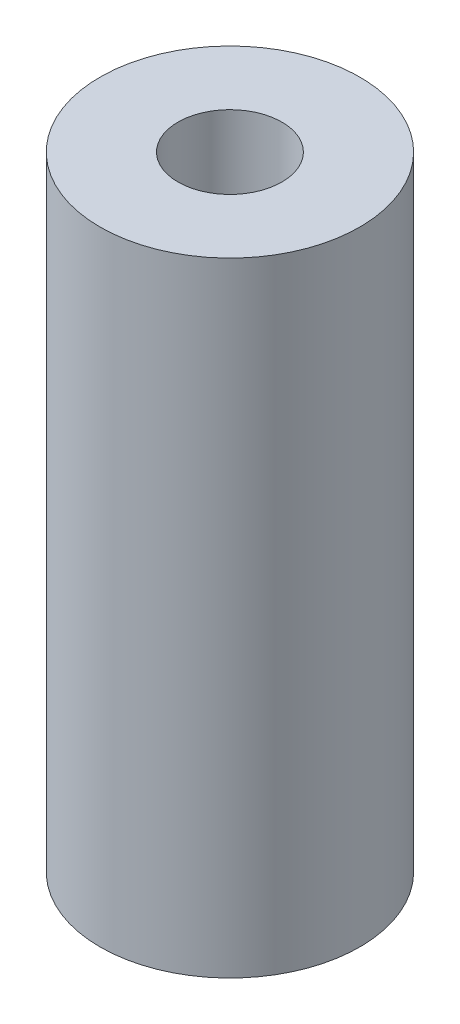
ISO-10303-21;
HEADER;
FILE_DESCRIPTION(('STEP AP214'),'2;1');
FILE_NAME('part.step','',(''),(''),'','','');
FILE_SCHEMA(('AUTOMOTIVE_DESIGN { 1 0 10303 214 1 1 1 1 }'));
ENDSEC;
DATA;
#1=APPLICATION_CONTEXT('core data for automotive mechanical design processes');
#2=APPLICATION_PROTOCOL_DEFINITION('international standard','automotive_design',2000,#1);
#3=PRODUCT_CONTEXT('',#1,'mechanical');
#4=PRODUCT('Part','Part','',(#3));
#5=PRODUCT_RELATED_PRODUCT_CATEGORY('part','',(#4));
#6=PRODUCT_DEFINITION_FORMATION('','',#4);
#7=PRODUCT_DEFINITION_CONTEXT('part definition',#1,'design');
#8=PRODUCT_DEFINITION('design','',#6,#7);
#9=PRODUCT_DEFINITION_SHAPE('','',#8);
#10=(LENGTH_UNIT() NAMED_UNIT(*) SI_UNIT(.MILLI.,.METRE.));
#11=(NAMED_UNIT(*) PLANE_ANGLE_UNIT() SI_UNIT($,.RADIAN.));
#12=(NAMED_UNIT(*) SI_UNIT($,.STERADIAN.) SOLID_ANGLE_UNIT());
#13=UNCERTAINTY_MEASURE_WITH_UNIT(LENGTH_MEASURE(1.E-05),#10,'distance_accuracy_value','');
#14=(GEOMETRIC_REPRESENTATION_CONTEXT(3) GLOBAL_UNCERTAINTY_ASSIGNED_CONTEXT((#13)) GLOBAL_UNIT_ASSIGNED_CONTEXT((#10,
#11,#12)) REPRESENTATION_CONTEXT('',''));
#15=CARTESIAN_POINT('',(0.,0.,0.));
#16=DIRECTION('',(0.,0.,1.));
#17=DIRECTION('',(1.,0.,0.));
#18=AXIS2_PLACEMENT_3D('',#15,#16,#17);
#19=CARTESIAN_POINT('',(0.,30.48,0.));
#20=DIRECTION('',(0.,1.,0.));
#21=DIRECTION('',(0.,0.,1.));
#22=AXIS2_PLACEMENT_3D('',#19,#20,#21);
#23=PLANE('',#22);
#24=CARTESIAN_POINT('',(0.,30.48,0.));
#25=DIRECTION('',(0.,1.,0.));
#26=DIRECTION('',(0.,0.,1.));
#27=AXIS2_PLACEMENT_3D('',#24,#25,#26);
#28=CIRCLE('',#27,6.35);
#29=CARTESIAN_POINT('',(0.,30.48,6.35));
#30=VERTEX_POINT('',#29);
#31=EDGE_CURVE('E10',#30,#30,#28,.T.);
#32=ORIENTED_EDGE('',*,*,#31,.T.);
#33=EDGE_LOOP('',(#32));
#34=FACE_BOUND('',#33,.T.);
#35=CARTESIAN_POINT('',(0.,30.48,0.));
#36=DIRECTION('',(0.,1.,0.));
#37=DIRECTION('',(0.,0.,1.));
#38=AXIS2_PLACEMENT_3D('',#35,#36,#37);
#39=CIRCLE('',#38,2.54);
#40=CARTESIAN_POINT('',(0.,30.48,2.54));
#41=VERTEX_POINT('',#40);
#42=EDGE_CURVE('E48',#41,#41,#39,.T.);
#43=ORIENTED_EDGE('',*,*,#42,.F.);
#44=EDGE_LOOP('',(#43));
#45=FACE_BOUND('',#44,.T.);
#46=ADVANCED_FACE('F37',(#34,#45),#23,.T.);
#47=CARTESIAN_POINT('',(0.,0.,0.));
#48=DIRECTION('',(0.,1.,0.));
#49=DIRECTION('',(0.,0.,1.));
#50=AXIS2_PLACEMENT_3D('',#47,#48,#49);
#51=PLANE('',#50);
#52=CARTESIAN_POINT('',(0.,0.,0.));
#53=DIRECTION('',(0.,1.,0.));
#54=DIRECTION('',(0.,0.,1.));
#55=AXIS2_PLACEMENT_3D('',#52,#53,#54);
#56=CIRCLE('',#55,6.35);
#57=CARTESIAN_POINT('',(0.,0.,6.35));
#58=VERTEX_POINT('',#57);
#59=EDGE_CURVE('E41',#58,#58,#56,.T.);
#60=ORIENTED_EDGE('',*,*,#59,.F.);
#61=EDGE_LOOP('',(#60));
#62=FACE_BOUND('',#61,.T.);
#63=CARTESIAN_POINT('',(0.,0.,0.));
#64=DIRECTION('',(0.,1.,0.));
#65=DIRECTION('',(0.,0.,1.));
#66=AXIS2_PLACEMENT_3D('',#63,#64,#65);
#67=CIRCLE('',#66,2.54);
#68=CARTESIAN_POINT('',(0.,0.,2.54));
#69=VERTEX_POINT('',#68);
#70=EDGE_CURVE('E50',#69,#69,#67,.T.);
#71=ORIENTED_EDGE('',*,*,#70,.T.);
#72=EDGE_LOOP('',(#71));
#73=FACE_BOUND('',#72,.T.);
#74=ADVANCED_FACE('F60',(#62,#73),#51,.F.);
#75=CARTESIAN_POINT('',(0.,30.48,0.));
#76=DIRECTION('',(0.,-1.,0.));
#77=DIRECTION('',(0.,0.,-1.));
#78=AXIS2_PLACEMENT_3D('',#75,#76,#77);
#79=CYLINDRICAL_SURFACE('',#78,6.35);
#80=ORIENTED_EDGE('',*,*,#31,.F.);
#81=EDGE_LOOP('',(#80));
#82=FACE_BOUND('',#81,.T.);
#83=ORIENTED_EDGE('',*,*,#59,.T.);
#84=EDGE_LOOP('',(#83));
#85=FACE_BOUND('',#84,.T.);
#86=ADVANCED_FACE('F39',(#82,#85),#79,.T.);
#87=CARTESIAN_POINT('',(0.,30.48,0.));
#88=DIRECTION('',(0.,-1.,0.));
#89=DIRECTION('',(0.,0.,-1.));
#90=AXIS2_PLACEMENT_3D('',#87,#88,#89);
#91=CYLINDRICAL_SURFACE('',#90,2.54);
#92=ORIENTED_EDGE('',*,*,#42,.T.);
#93=EDGE_LOOP('',(#92));
#94=FACE_BOUND('',#93,.T.);
#95=ORIENTED_EDGE('',*,*,#70,.F.);
#96=EDGE_LOOP('',(#95));
#97=FACE_BOUND('',#96,.T.);
#98=ADVANCED_FACE('F56',(#94,#97),#91,.F.);
#99=CLOSED_SHELL('',(#46,#74,#86,#98));
#100=MANIFOLD_SOLID_BREP('B2',#99);
#101=ADVANCED_BREP_SHAPE_REPRESENTATION('',(#18,#100),#14);
#102=SHAPE_DEFINITION_REPRESENTATION(#9,#101);
ENDSEC;
END-ISO-10303-21;
